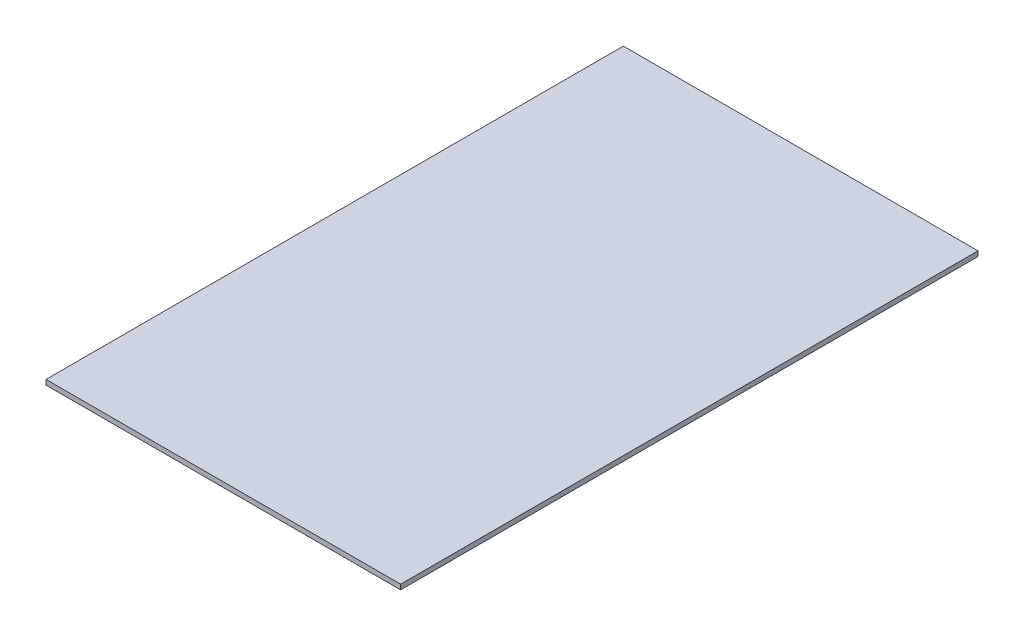
ISO-10303-21;
HEADER;
FILE_DESCRIPTION(('STEP AP214'),'2;1');
FILE_NAME('part.step','',(''),(''),'','','');
FILE_SCHEMA(('AUTOMOTIVE_DESIGN { 1 0 10303 214 1 1 1 1 }'));
ENDSEC;
DATA;
#1=APPLICATION_CONTEXT('core data for automotive mechanical design processes');
#2=APPLICATION_PROTOCOL_DEFINITION('international standard','automotive_design',2000,#1);
#3=PRODUCT_CONTEXT('',#1,'mechanical');
#4=PRODUCT('Part','Part','',(#3));
#5=PRODUCT_RELATED_PRODUCT_CATEGORY('part','',(#4));
#6=PRODUCT_DEFINITION_FORMATION('','',#4);
#7=PRODUCT_DEFINITION_CONTEXT('part definition',#1,'design');
#8=PRODUCT_DEFINITION('design','',#6,#7);
#9=PRODUCT_DEFINITION_SHAPE('','',#8);
#10=(LENGTH_UNIT() NAMED_UNIT(*) SI_UNIT(.MILLI.,.METRE.));
#11=(NAMED_UNIT(*) PLANE_ANGLE_UNIT() SI_UNIT($,.RADIAN.));
#12=(NAMED_UNIT(*) SI_UNIT($,.STERADIAN.) SOLID_ANGLE_UNIT());
#13=UNCERTAINTY_MEASURE_WITH_UNIT(LENGTH_MEASURE(1.E-05),#10,'distance_accuracy_value','');
#14=(GEOMETRIC_REPRESENTATION_CONTEXT(3) GLOBAL_UNCERTAINTY_ASSIGNED_CONTEXT((#13)) GLOBAL_UNIT_ASSIGNED_CONTEXT((#10,
#11,#12)) REPRESENTATION_CONTEXT('',''));
#15=CARTESIAN_POINT('',(0.,0.,0.));
#16=DIRECTION('',(0.,0.,1.));
#17=DIRECTION('',(1.,0.,0.));
#18=AXIS2_PLACEMENT_3D('',#15,#16,#17);
#19=CARTESIAN_POINT('',(-107.5,-13.,227.5));
#20=DIRECTION('',(1.,0.,0.));
#21=DIRECTION('',(0.,1.,0.));
#22=AXIS2_PLACEMENT_3D('',#19,#20,#21);
#23=PLANE('',#22);
#24=DIRECTION('',(0.,0.,-1.));
#25=VECTOR('',#24,1.);
#26=CARTESIAN_POINT('',(-107.5,-9.99999999999998,227.5));
#27=LINE('',#26,#25);
#28=CARTESIAN_POINT('',(-107.5,-9.99999999999998,227.5));
#29=VERTEX_POINT('',#28);
#30=CARTESIAN_POINT('',(-107.5,-9.99999999999998,-122.5));
#31=VERTEX_POINT('',#30);
#32=EDGE_CURVE('E100',#29,#31,#27,.T.);
#33=ORIENTED_EDGE('',*,*,#32,.T.);
#34=DIRECTION('',(0.,1.,0.));
#35=VECTOR('',#34,1.);
#36=CARTESIAN_POINT('',(-107.5,-13.,-122.5));
#37=LINE('',#36,#35);
#38=CARTESIAN_POINT('',(-107.5,-13.,-122.5));
#39=VERTEX_POINT('',#38);
#40=EDGE_CURVE('E11',#39,#31,#37,.T.);
#41=ORIENTED_EDGE('',*,*,#40,.F.);
#42=DIRECTION('',(0.,0.,-1.));
#43=VECTOR('',#42,1.);
#44=CARTESIAN_POINT('',(-107.5,-13.,227.5));
#45=LINE('',#44,#43);
#46=CARTESIAN_POINT('',(-107.5,-13.,227.5));
#47=VERTEX_POINT('',#46);
#48=EDGE_CURVE('E88',#47,#39,#45,.T.);
#49=ORIENTED_EDGE('',*,*,#48,.F.);
#50=DIRECTION('',(0.,1.,0.));
#51=VECTOR('',#50,1.);
#52=CARTESIAN_POINT('',(-107.5,-13.,227.5));
#53=LINE('',#52,#51);
#54=EDGE_CURVE('E96',#47,#29,#53,.T.);
#55=ORIENTED_EDGE('',*,*,#54,.T.);
#56=EDGE_LOOP('',(#33,#41,#49,#55));
#57=FACE_BOUND('',#56,.T.);
#58=ADVANCED_FACE('F37',(#57),#23,.F.);
#59=CARTESIAN_POINT('',(-107.5,-13.,-122.5));
#60=DIRECTION('',(0.,0.,1.));
#61=DIRECTION('',(0.,-1.,0.));
#62=AXIS2_PLACEMENT_3D('',#59,#60,#61);
#63=PLANE('',#62);
#64=DIRECTION('',(1.,0.,0.));
#65=VECTOR('',#64,1.);
#66=CARTESIAN_POINT('',(-107.5,-9.99999999999998,-122.5));
#67=LINE('',#66,#65);
#68=CARTESIAN_POINT('',(107.5,-9.99999999999873,-122.5));
#69=VERTEX_POINT('',#68);
#70=EDGE_CURVE('E92',#31,#69,#67,.T.);
#71=ORIENTED_EDGE('',*,*,#70,.T.);
#72=DIRECTION('',(0.,1.,0.));
#73=VECTOR('',#72,1.);
#74=CARTESIAN_POINT('',(107.5,-12.9999999999987,-122.5));
#75=LINE('',#74,#73);
#76=CARTESIAN_POINT('',(107.5,-12.9999999999987,-122.5));
#77=VERTEX_POINT('',#76);
#78=EDGE_CURVE('E45',#77,#69,#75,.T.);
#79=ORIENTED_EDGE('',*,*,#78,.F.);
#80=DIRECTION('',(1.,0.,0.));
#81=VECTOR('',#80,1.);
#82=CARTESIAN_POINT('',(-107.5,-13.,-122.5));
#83=LINE('',#82,#81);
#84=EDGE_CURVE('E83',#39,#77,#83,.T.);
#85=ORIENTED_EDGE('',*,*,#84,.F.);
#86=ORIENTED_EDGE('',*,*,#40,.T.);
#87=EDGE_LOOP('',(#71,#79,#85,#86));
#88=FACE_BOUND('',#87,.T.);
#89=ADVANCED_FACE('F91',(#88),#63,.F.);
#90=CARTESIAN_POINT('',(107.5,-12.9999999999987,227.5));
#91=DIRECTION('',(-1.,0.,0.));
#92=DIRECTION('',(0.,-1.,0.));
#93=AXIS2_PLACEMENT_3D('',#90,#91,#92);
#94=PLANE('',#93);
#95=DIRECTION('',(0.,0.,1.));
#96=VECTOR('',#95,1.);
#97=CARTESIAN_POINT('',(107.5,-9.99999999999873,227.5));
#98=LINE('',#97,#96);
#99=CARTESIAN_POINT('',(107.5,-9.99999999999873,227.5));
#100=VERTEX_POINT('',#99);
#101=EDGE_CURVE('E70',#69,#100,#98,.T.);
#102=ORIENTED_EDGE('',*,*,#101,.T.);
#103=DIRECTION('',(0.,1.,0.));
#104=VECTOR('',#103,1.);
#105=CARTESIAN_POINT('',(107.5,-12.9999999999987,227.5));
#106=LINE('',#105,#104);
#107=CARTESIAN_POINT('',(107.5,-12.9999999999987,227.5));
#108=VERTEX_POINT('',#107);
#109=EDGE_CURVE('E93',#108,#100,#106,.T.);
#110=ORIENTED_EDGE('',*,*,#109,.F.);
#111=DIRECTION('',(0.,0.,1.));
#112=VECTOR('',#111,1.);
#113=CARTESIAN_POINT('',(107.5,-12.9999999999987,227.5));
#114=LINE('',#113,#112);
#115=EDGE_CURVE('E86',#77,#108,#114,.T.);
#116=ORIENTED_EDGE('',*,*,#115,.F.);
#117=ORIENTED_EDGE('',*,*,#78,.T.);
#118=EDGE_LOOP('',(#102,#110,#116,#117));
#119=FACE_BOUND('',#118,.T.);
#120=ADVANCED_FACE('F94',(#119),#94,.F.);
#121=CARTESIAN_POINT('',(-107.5,-13.,227.5));
#122=DIRECTION('',(0.,0.,-1.));
#123=DIRECTION('',(0.,1.,0.));
#124=AXIS2_PLACEMENT_3D('',#121,#122,#123);
#125=PLANE('',#124);
#126=DIRECTION('',(-1.,0.,0.));
#127=VECTOR('',#126,1.);
#128=CARTESIAN_POINT('',(-107.5,-9.99999999999998,227.5));
#129=LINE('',#128,#127);
#130=EDGE_CURVE('E76',#100,#29,#129,.T.);
#131=ORIENTED_EDGE('',*,*,#130,.T.);
#132=ORIENTED_EDGE('',*,*,#54,.F.);
#133=DIRECTION('',(-1.,0.,0.));
#134=VECTOR('',#133,1.);
#135=CARTESIAN_POINT('',(-107.5,-13.,227.5));
#136=LINE('',#135,#134);
#137=EDGE_CURVE('E53',#108,#47,#136,.T.);
#138=ORIENTED_EDGE('',*,*,#137,.F.);
#139=ORIENTED_EDGE('',*,*,#109,.T.);
#140=EDGE_LOOP('',(#131,#132,#138,#139));
#141=FACE_BOUND('',#140,.T.);
#142=ADVANCED_FACE('F107',(#141),#125,.F.);
#143=CARTESIAN_POINT('',(0.,-12.9999999999994,0.));
#144=DIRECTION('',(0.,-1.,0.));
#145=DIRECTION('',(1.,0.,0.));
#146=AXIS2_PLACEMENT_3D('',#143,#144,#145);
#147=PLANE('',#146);
#148=ORIENTED_EDGE('',*,*,#48,.T.);
#149=ORIENTED_EDGE('',*,*,#84,.T.);
#150=ORIENTED_EDGE('',*,*,#115,.T.);
#151=ORIENTED_EDGE('',*,*,#137,.T.);
#152=EDGE_LOOP('',(#148,#149,#150,#151));
#153=FACE_BOUND('',#152,.T.);
#154=ADVANCED_FACE('F84',(#153),#147,.T.);
#155=CARTESIAN_POINT('',(0.,-9.99999999999936,0.));
#156=DIRECTION('',(0.,-1.,0.));
#157=DIRECTION('',(1.,0.,0.));
#158=AXIS2_PLACEMENT_3D('',#155,#156,#157);
#159=PLANE('',#158);
#160=ORIENTED_EDGE('',*,*,#32,.F.);
#161=ORIENTED_EDGE('',*,*,#130,.F.);
#162=ORIENTED_EDGE('',*,*,#101,.F.);
#163=ORIENTED_EDGE('',*,*,#70,.F.);
#164=EDGE_LOOP('',(#160,#161,#162,#163));
#165=FACE_BOUND('',#164,.T.);
#166=ADVANCED_FACE('F110',(#165),#159,.F.);
#167=CLOSED_SHELL('',(#58,#89,#120,#142,#154,#166));
#168=MANIFOLD_SOLID_BREP('B2',#167);
#169=ADVANCED_BREP_SHAPE_REPRESENTATION('',(#18,#168),#14);
#170=SHAPE_DEFINITION_REPRESENTATION(#9,#169);
ENDSEC;
END-ISO-10303-21;
